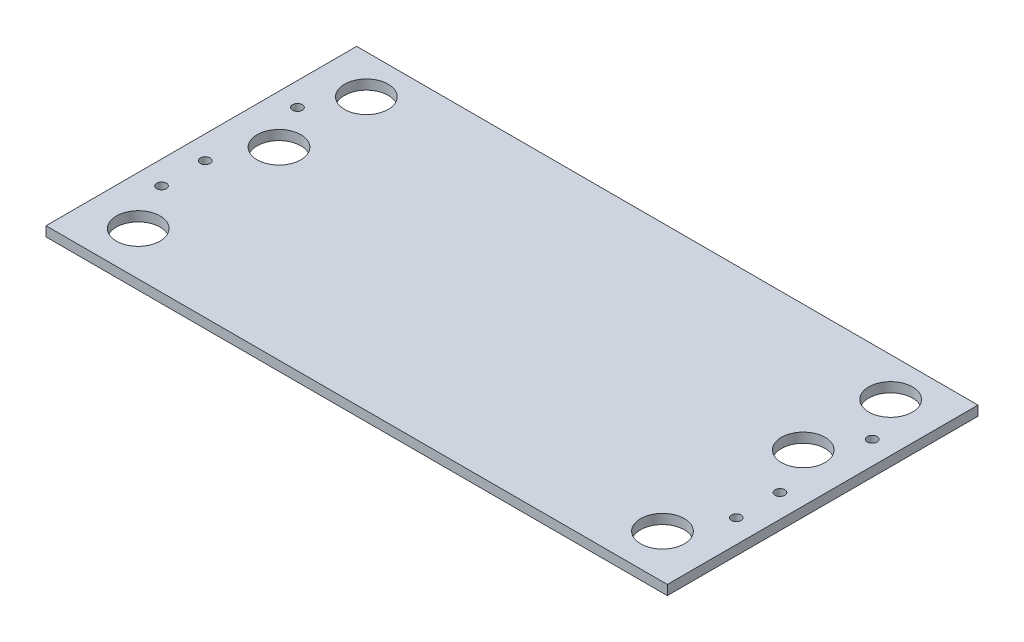
ISO-10303-21;
HEADER;
FILE_DESCRIPTION(('STEP AP214'),'2;1');
FILE_NAME('part.step','',(''),(''),'','','');
FILE_SCHEMA(('AUTOMOTIVE_DESIGN { 1 0 10303 214 1 1 1 1 }'));
ENDSEC;
DATA;
#1=APPLICATION_CONTEXT('core data for automotive mechanical design processes');
#2=APPLICATION_PROTOCOL_DEFINITION('international standard','automotive_design',2000,#1);
#3=PRODUCT_CONTEXT('',#1,'mechanical');
#4=PRODUCT('Part','Part','',(#3));
#5=PRODUCT_RELATED_PRODUCT_CATEGORY('part','',(#4));
#6=PRODUCT_DEFINITION_FORMATION('','',#4);
#7=PRODUCT_DEFINITION_CONTEXT('part definition',#1,'design');
#8=PRODUCT_DEFINITION('design','',#6,#7);
#9=PRODUCT_DEFINITION_SHAPE('','',#8);
#10=(LENGTH_UNIT() NAMED_UNIT(*) SI_UNIT(.MILLI.,.METRE.));
#11=(NAMED_UNIT(*) PLANE_ANGLE_UNIT() SI_UNIT($,.RADIAN.));
#12=(NAMED_UNIT(*) SI_UNIT($,.STERADIAN.) SOLID_ANGLE_UNIT());
#13=UNCERTAINTY_MEASURE_WITH_UNIT(LENGTH_MEASURE(1.E-05),#10,'distance_accuracy_value','');
#14=(GEOMETRIC_REPRESENTATION_CONTEXT(3) GLOBAL_UNCERTAINTY_ASSIGNED_CONTEXT((#13)) GLOBAL_UNIT_ASSIGNED_CONTEXT((#10,
#11,#12)) REPRESENTATION_CONTEXT('',''));
#15=CARTESIAN_POINT('',(0.,0.,0.));
#16=DIRECTION('',(0.,0.,1.));
#17=DIRECTION('',(1.,0.,0.));
#18=AXIS2_PLACEMENT_3D('',#15,#16,#17);
#19=CARTESIAN_POINT('',(0.,6.35,0.));
#20=DIRECTION('',(0.,-1.,0.));
#21=DIRECTION('',(0.,0.,-1.));
#22=AXIS2_PLACEMENT_3D('',#19,#20,#21);
#23=PLANE('',#22);
#24=DIRECTION('',(1.,0.,0.));
#25=VECTOR('',#24,1.);
#26=CARTESIAN_POINT('',(203.2,6.35,101.6));
#27=LINE('',#26,#25);
#28=CARTESIAN_POINT('',(-203.2,6.35,101.6));
#29=VERTEX_POINT('',#28);
#30=CARTESIAN_POINT('',(203.2,6.35,101.6));
#31=VERTEX_POINT('',#30);
#32=EDGE_CURVE('E96',#29,#31,#27,.T.);
#33=ORIENTED_EDGE('',*,*,#32,.T.);
#34=DIRECTION('',(0.,0.,-1.));
#35=VECTOR('',#34,1.);
#36=CARTESIAN_POINT('',(203.2,6.35,-101.6));
#37=LINE('',#36,#35);
#38=CARTESIAN_POINT('',(203.2,6.35,-101.6));
#39=VERTEX_POINT('',#38);
#40=EDGE_CURVE('E91',#31,#39,#37,.T.);
#41=ORIENTED_EDGE('',*,*,#40,.T.);
#42=DIRECTION('',(-1.,0.,0.));
#43=VECTOR('',#42,1.);
#44=CARTESIAN_POINT('',(-203.2,6.35,-101.6));
#45=LINE('',#44,#43);
#46=CARTESIAN_POINT('',(-203.2,6.35,-101.6));
#47=VERTEX_POINT('',#46);
#48=EDGE_CURVE('E94',#39,#47,#45,.T.);
#49=ORIENTED_EDGE('',*,*,#48,.T.);
#50=DIRECTION('',(0.,0.,1.));
#51=VECTOR('',#50,1.);
#52=CARTESIAN_POINT('',(-203.2,6.35,101.6));
#53=LINE('',#52,#51);
#54=EDGE_CURVE('E61',#47,#29,#53,.T.);
#55=ORIENTED_EDGE('',*,*,#54,.T.);
#56=EDGE_LOOP('',(#33,#41,#49,#55));
#57=FACE_BOUND('',#56,.T.);
#58=CARTESIAN_POINT('',(-171.45,6.35,-76.2));
#59=DIRECTION('',(0.,1.,0.));
#60=DIRECTION('',(0.,0.,1.));
#61=AXIS2_PLACEMENT_3D('',#58,#59,#60);
#62=CIRCLE('',#61,14.2875);
#63=CARTESIAN_POINT('',(-171.45,6.35,-61.9125));
#64=VERTEX_POINT('',#63);
#65=EDGE_CURVE('E116',#64,#64,#62,.T.);
#66=ORIENTED_EDGE('',*,*,#65,.F.);
#67=EDGE_LOOP('',(#66));
#68=FACE_BOUND('',#67,.T.);
#69=CARTESIAN_POINT('',(-171.45,6.35,-19.05));
#70=DIRECTION('',(0.,1.,0.));
#71=DIRECTION('',(0.,0.,1.));
#72=AXIS2_PLACEMENT_3D('',#69,#70,#71);
#73=CIRCLE('',#72,14.2875);
#74=CARTESIAN_POINT('',(-171.45,6.35,-4.76249999999999));
#75=VERTEX_POINT('',#74);
#76=EDGE_CURVE('E138',#75,#75,#73,.T.);
#77=ORIENTED_EDGE('',*,*,#76,.F.);
#78=EDGE_LOOP('',(#77));
#79=FACE_BOUND('',#78,.T.);
#80=CARTESIAN_POINT('',(171.45,6.35,-76.2));
#81=DIRECTION('',(0.,1.,0.));
#82=DIRECTION('',(0.,0.,1.));
#83=AXIS2_PLACEMENT_3D('',#80,#81,#82);
#84=CIRCLE('',#83,14.2875);
#85=CARTESIAN_POINT('',(171.45,6.35,-61.9125));
#86=VERTEX_POINT('',#85);
#87=EDGE_CURVE('E146',#86,#86,#84,.T.);
#88=ORIENTED_EDGE('',*,*,#87,.F.);
#89=EDGE_LOOP('',(#88));
#90=FACE_BOUND('',#89,.T.);
#91=CARTESIAN_POINT('',(171.45,6.35,-19.05));
#92=DIRECTION('',(0.,1.,0.));
#93=DIRECTION('',(0.,0.,1.));
#94=AXIS2_PLACEMENT_3D('',#91,#92,#93);
#95=CIRCLE('',#94,14.2875);
#96=CARTESIAN_POINT('',(171.45,6.35,-4.76249999999999));
#97=VERTEX_POINT('',#96);
#98=EDGE_CURVE('E154',#97,#97,#95,.T.);
#99=ORIENTED_EDGE('',*,*,#98,.F.);
#100=EDGE_LOOP('',(#99));
#101=FACE_BOUND('',#100,.T.);
#102=CARTESIAN_POINT('',(171.45,6.35,73.025));
#103=DIRECTION('',(0.,1.,0.));
#104=DIRECTION('',(0.,0.,1.));
#105=AXIS2_PLACEMENT_3D('',#102,#103,#104);
#106=CIRCLE('',#105,14.2875);
#107=CARTESIAN_POINT('',(171.45,6.35,87.3125));
#108=VERTEX_POINT('',#107);
#109=EDGE_CURVE('E162',#108,#108,#106,.T.);
#110=ORIENTED_EDGE('',*,*,#109,.F.);
#111=EDGE_LOOP('',(#110));
#112=FACE_BOUND('',#111,.T.);
#113=CARTESIAN_POINT('',(-171.45,6.35,73.025));
#114=DIRECTION('',(0.,1.,0.));
#115=DIRECTION('',(0.,0.,1.));
#116=AXIS2_PLACEMENT_3D('',#113,#114,#115);
#117=CIRCLE('',#116,14.2875);
#118=CARTESIAN_POINT('',(-171.45,6.35,87.3125));
#119=VERTEX_POINT('',#118);
#120=EDGE_CURVE('E170',#119,#119,#117,.T.);
#121=ORIENTED_EDGE('',*,*,#120,.F.);
#122=EDGE_LOOP('',(#121));
#123=FACE_BOUND('',#122,.T.);
#124=CARTESIAN_POINT('',(-187.96,6.35,12.7));
#125=DIRECTION('',(0.,1.,0.));
#126=DIRECTION('',(0.,0.,1.));
#127=AXIS2_PLACEMENT_3D('',#124,#125,#126);
#128=CIRCLE('',#127,3.175);
#129=CARTESIAN_POINT('',(-187.96,6.35,15.875));
#130=VERTEX_POINT('',#129);
#131=EDGE_CURVE('E178',#130,#130,#128,.T.);
#132=ORIENTED_EDGE('',*,*,#131,.F.);
#133=EDGE_LOOP('',(#132));
#134=FACE_BOUND('',#133,.T.);
#135=CARTESIAN_POINT('',(-187.96,6.35,41.275));
#136=DIRECTION('',(0.,1.,0.));
#137=DIRECTION('',(0.,0.,1.));
#138=AXIS2_PLACEMENT_3D('',#135,#136,#137);
#139=CIRCLE('',#138,3.175);
#140=CARTESIAN_POINT('',(-187.96,6.35,44.45));
#141=VERTEX_POINT('',#140);
#142=EDGE_CURVE('E186',#141,#141,#139,.T.);
#143=ORIENTED_EDGE('',*,*,#142,.F.);
#144=EDGE_LOOP('',(#143));
#145=FACE_BOUND('',#144,.T.);
#146=CARTESIAN_POINT('',(187.96,6.35,41.275));
#147=DIRECTION('',(0.,1.,0.));
#148=DIRECTION('',(0.,0.,-1.));
#149=AXIS2_PLACEMENT_3D('',#146,#147,#148);
#150=CIRCLE('',#149,3.175);
#151=CARTESIAN_POINT('',(187.96,6.35,38.1));
#152=VERTEX_POINT('',#151);
#153=EDGE_CURVE('E194',#152,#152,#150,.T.);
#154=ORIENTED_EDGE('',*,*,#153,.F.);
#155=EDGE_LOOP('',(#154));
#156=FACE_BOUND('',#155,.T.);
#157=CARTESIAN_POINT('',(187.96,6.35,12.7));
#158=DIRECTION('',(0.,1.,0.));
#159=DIRECTION('',(0.,0.,-1.));
#160=AXIS2_PLACEMENT_3D('',#157,#158,#159);
#161=CIRCLE('',#160,3.175);
#162=CARTESIAN_POINT('',(187.96,6.35,9.52500000000001));
#163=VERTEX_POINT('',#162);
#164=EDGE_CURVE('E202',#163,#163,#161,.T.);
#165=ORIENTED_EDGE('',*,*,#164,.F.);
#166=EDGE_LOOP('',(#165));
#167=FACE_BOUND('',#166,.T.);
#168=CARTESIAN_POINT('',(-187.96,6.35,-47.625));
#169=DIRECTION('',(0.,1.,0.));
#170=DIRECTION('',(0.,0.,1.));
#171=AXIS2_PLACEMENT_3D('',#168,#169,#170);
#172=CIRCLE('',#171,3.175);
#173=CARTESIAN_POINT('',(-187.96,6.35,-44.45));
#174=VERTEX_POINT('',#173);
#175=EDGE_CURVE('E210',#174,#174,#172,.T.);
#176=ORIENTED_EDGE('',*,*,#175,.F.);
#177=EDGE_LOOP('',(#176));
#178=FACE_BOUND('',#177,.T.);
#179=CARTESIAN_POINT('',(187.96,6.35,-47.6249999999999));
#180=DIRECTION('',(0.,1.,0.));
#181=DIRECTION('',(0.,0.,-1.));
#182=AXIS2_PLACEMENT_3D('',#179,#180,#181);
#183=CIRCLE('',#182,3.175);
#184=CARTESIAN_POINT('',(187.96,6.35,-50.7999999999999));
#185=VERTEX_POINT('',#184);
#186=EDGE_CURVE('E218',#185,#185,#183,.T.);
#187=ORIENTED_EDGE('',*,*,#186,.F.);
#188=EDGE_LOOP('',(#187));
#189=FACE_BOUND('',#188,.T.);
#190=ADVANCED_FACE('F43',(#57,#68,#79,#90,#101,#112,#123,#134,#145,#156,#167,#178,#189),#23,.F.);
#191=CARTESIAN_POINT('',(0.,0.,0.));
#192=DIRECTION('',(0.,-1.,0.));
#193=DIRECTION('',(0.,0.,-1.));
#194=AXIS2_PLACEMENT_3D('',#191,#192,#193);
#195=PLANE('',#194);
#196=CARTESIAN_POINT('',(-187.96,0.,-47.625));
#197=DIRECTION('',(0.,1.,0.));
#198=DIRECTION('',(0.,0.,1.));
#199=AXIS2_PLACEMENT_3D('',#196,#197,#198);
#200=CIRCLE('',#199,3.175);
#201=CARTESIAN_POINT('',(-187.96,0.,-44.45));
#202=VERTEX_POINT('',#201);
#203=EDGE_CURVE('E214',#202,#202,#200,.T.);
#204=ORIENTED_EDGE('',*,*,#203,.T.);
#205=EDGE_LOOP('',(#204));
#206=FACE_BOUND('',#205,.T.);
#207=CARTESIAN_POINT('',(187.96,0.,41.275));
#208=DIRECTION('',(0.,1.,0.));
#209=DIRECTION('',(0.,0.,-1.));
#210=AXIS2_PLACEMENT_3D('',#207,#208,#209);
#211=CIRCLE('',#210,3.175);
#212=CARTESIAN_POINT('',(187.96,0.,38.1));
#213=VERTEX_POINT('',#212);
#214=EDGE_CURVE('E198',#213,#213,#211,.T.);
#215=ORIENTED_EDGE('',*,*,#214,.T.);
#216=EDGE_LOOP('',(#215));
#217=FACE_BOUND('',#216,.T.);
#218=CARTESIAN_POINT('',(-187.96,0.,12.7));
#219=DIRECTION('',(0.,1.,0.));
#220=DIRECTION('',(0.,0.,1.));
#221=AXIS2_PLACEMENT_3D('',#218,#219,#220);
#222=CIRCLE('',#221,3.175);
#223=CARTESIAN_POINT('',(-187.96,0.,15.875));
#224=VERTEX_POINT('',#223);
#225=EDGE_CURVE('E182',#224,#224,#222,.T.);
#226=ORIENTED_EDGE('',*,*,#225,.T.);
#227=EDGE_LOOP('',(#226));
#228=FACE_BOUND('',#227,.T.);
#229=CARTESIAN_POINT('',(171.45,0.,73.025));
#230=DIRECTION('',(0.,1.,0.));
#231=DIRECTION('',(0.,0.,1.));
#232=AXIS2_PLACEMENT_3D('',#229,#230,#231);
#233=CIRCLE('',#232,14.2875);
#234=CARTESIAN_POINT('',(171.45,0.,87.3125));
#235=VERTEX_POINT('',#234);
#236=EDGE_CURVE('E166',#235,#235,#233,.T.);
#237=ORIENTED_EDGE('',*,*,#236,.T.);
#238=EDGE_LOOP('',(#237));
#239=FACE_BOUND('',#238,.T.);
#240=CARTESIAN_POINT('',(171.45,0.,-76.2));
#241=DIRECTION('',(0.,1.,0.));
#242=DIRECTION('',(0.,0.,1.));
#243=AXIS2_PLACEMENT_3D('',#240,#241,#242);
#244=CIRCLE('',#243,14.2875);
#245=CARTESIAN_POINT('',(171.45,0.,-61.9125));
#246=VERTEX_POINT('',#245);
#247=EDGE_CURVE('E150',#246,#246,#244,.T.);
#248=ORIENTED_EDGE('',*,*,#247,.T.);
#249=EDGE_LOOP('',(#248));
#250=FACE_BOUND('',#249,.T.);
#251=CARTESIAN_POINT('',(-171.45,0.,-76.2));
#252=DIRECTION('',(0.,1.,0.));
#253=DIRECTION('',(0.,0.,1.));
#254=AXIS2_PLACEMENT_3D('',#251,#252,#253);
#255=CIRCLE('',#254,14.2875);
#256=CARTESIAN_POINT('',(-171.45,0.,-61.9125));
#257=VERTEX_POINT('',#256);
#258=EDGE_CURVE('E134',#257,#257,#255,.T.);
#259=ORIENTED_EDGE('',*,*,#258,.T.);
#260=EDGE_LOOP('',(#259));
#261=FACE_BOUND('',#260,.T.);
#262=DIRECTION('',(1.,0.,0.));
#263=VECTOR('',#262,1.);
#264=CARTESIAN_POINT('',(203.2,0.,101.6));
#265=LINE('',#264,#263);
#266=CARTESIAN_POINT('',(-203.2,0.,101.6));
#267=VERTEX_POINT('',#266);
#268=CARTESIAN_POINT('',(203.2,0.,101.6));
#269=VERTEX_POINT('',#268);
#270=EDGE_CURVE('E112',#267,#269,#265,.T.);
#271=ORIENTED_EDGE('',*,*,#270,.F.);
#272=DIRECTION('',(0.,0.,1.));
#273=VECTOR('',#272,1.);
#274=CARTESIAN_POINT('',(-203.2,0.,101.6));
#275=LINE('',#274,#273);
#276=CARTESIAN_POINT('',(-203.2,0.,-101.6));
#277=VERTEX_POINT('',#276);
#278=EDGE_CURVE('E84',#277,#267,#275,.T.);
#279=ORIENTED_EDGE('',*,*,#278,.F.);
#280=DIRECTION('',(-1.,0.,0.));
#281=VECTOR('',#280,1.);
#282=CARTESIAN_POINT('',(-203.2,0.,-101.6));
#283=LINE('',#282,#281);
#284=CARTESIAN_POINT('',(203.2,0.,-101.6));
#285=VERTEX_POINT('',#284);
#286=EDGE_CURVE('E78',#285,#277,#283,.T.);
#287=ORIENTED_EDGE('',*,*,#286,.F.);
#288=DIRECTION('',(0.,0.,-1.));
#289=VECTOR('',#288,1.);
#290=CARTESIAN_POINT('',(203.2,0.,-101.6));
#291=LINE('',#290,#289);
#292=EDGE_CURVE('E101',#269,#285,#291,.T.);
#293=ORIENTED_EDGE('',*,*,#292,.F.);
#294=EDGE_LOOP('',(#271,#279,#287,#293));
#295=FACE_BOUND('',#294,.T.);
#296=CARTESIAN_POINT('',(-171.45,0.,-19.05));
#297=DIRECTION('',(0.,1.,0.));
#298=DIRECTION('',(0.,0.,1.));
#299=AXIS2_PLACEMENT_3D('',#296,#297,#298);
#300=CIRCLE('',#299,14.2875);
#301=CARTESIAN_POINT('',(-171.45,0.,-4.76249999999999));
#302=VERTEX_POINT('',#301);
#303=EDGE_CURVE('E142',#302,#302,#300,.T.);
#304=ORIENTED_EDGE('',*,*,#303,.T.);
#305=EDGE_LOOP('',(#304));
#306=FACE_BOUND('',#305,.T.);
#307=CARTESIAN_POINT('',(171.45,0.,-19.05));
#308=DIRECTION('',(0.,1.,0.));
#309=DIRECTION('',(0.,0.,1.));
#310=AXIS2_PLACEMENT_3D('',#307,#308,#309);
#311=CIRCLE('',#310,14.2875);
#312=CARTESIAN_POINT('',(171.45,0.,-4.76249999999999));
#313=VERTEX_POINT('',#312);
#314=EDGE_CURVE('E158',#313,#313,#311,.T.);
#315=ORIENTED_EDGE('',*,*,#314,.T.);
#316=EDGE_LOOP('',(#315));
#317=FACE_BOUND('',#316,.T.);
#318=CARTESIAN_POINT('',(-171.45,0.,73.025));
#319=DIRECTION('',(0.,1.,0.));
#320=DIRECTION('',(0.,0.,1.));
#321=AXIS2_PLACEMENT_3D('',#318,#319,#320);
#322=CIRCLE('',#321,14.2875);
#323=CARTESIAN_POINT('',(-171.45,0.,87.3125));
#324=VERTEX_POINT('',#323);
#325=EDGE_CURVE('E174',#324,#324,#322,.T.);
#326=ORIENTED_EDGE('',*,*,#325,.T.);
#327=EDGE_LOOP('',(#326));
#328=FACE_BOUND('',#327,.T.);
#329=CARTESIAN_POINT('',(-187.96,0.,41.275));
#330=DIRECTION('',(0.,1.,0.));
#331=DIRECTION('',(0.,0.,1.));
#332=AXIS2_PLACEMENT_3D('',#329,#330,#331);
#333=CIRCLE('',#332,3.175);
#334=CARTESIAN_POINT('',(-187.96,0.,44.45));
#335=VERTEX_POINT('',#334);
#336=EDGE_CURVE('E190',#335,#335,#333,.T.);
#337=ORIENTED_EDGE('',*,*,#336,.T.);
#338=EDGE_LOOP('',(#337));
#339=FACE_BOUND('',#338,.T.);
#340=CARTESIAN_POINT('',(187.96,0.,12.7));
#341=DIRECTION('',(0.,1.,0.));
#342=DIRECTION('',(0.,0.,-1.));
#343=AXIS2_PLACEMENT_3D('',#340,#341,#342);
#344=CIRCLE('',#343,3.175);
#345=CARTESIAN_POINT('',(187.96,0.,9.52500000000001));
#346=VERTEX_POINT('',#345);
#347=EDGE_CURVE('E206',#346,#346,#344,.T.);
#348=ORIENTED_EDGE('',*,*,#347,.T.);
#349=EDGE_LOOP('',(#348));
#350=FACE_BOUND('',#349,.T.);
#351=CARTESIAN_POINT('',(187.96,0.,-47.6249999999999));
#352=DIRECTION('',(0.,1.,0.));
#353=DIRECTION('',(0.,0.,-1.));
#354=AXIS2_PLACEMENT_3D('',#351,#352,#353);
#355=CIRCLE('',#354,3.175);
#356=CARTESIAN_POINT('',(187.96,0.,-50.7999999999999));
#357=VERTEX_POINT('',#356);
#358=EDGE_CURVE('E222',#357,#357,#355,.T.);
#359=ORIENTED_EDGE('',*,*,#358,.T.);
#360=EDGE_LOOP('',(#359));
#361=FACE_BOUND('',#360,.T.);
#362=ADVANCED_FACE('F129',(#206,#217,#228,#239,#250,#261,#295,#306,#317,#328,#339,#350,#361),
#195,.T.);
#363=CARTESIAN_POINT('',(203.2,6.35,101.6));
#364=DIRECTION('',(0.,0.,-1.));
#365=DIRECTION('',(-1.,0.,0.));
#366=AXIS2_PLACEMENT_3D('',#363,#364,#365);
#367=PLANE('',#366);
#368=ORIENTED_EDGE('',*,*,#270,.T.);
#369=DIRECTION('',(0.,-1.,0.));
#370=VECTOR('',#369,1.);
#371=CARTESIAN_POINT('',(203.2,6.35,101.6));
#372=LINE('',#371,#370);
#373=EDGE_CURVE('E11',#31,#269,#372,.T.);
#374=ORIENTED_EDGE('',*,*,#373,.F.);
#375=ORIENTED_EDGE('',*,*,#32,.F.);
#376=DIRECTION('',(0.,-1.,0.));
#377=VECTOR('',#376,1.);
#378=CARTESIAN_POINT('',(-203.2,6.35,101.6));
#379=LINE('',#378,#377);
#380=EDGE_CURVE('E108',#29,#267,#379,.T.);
#381=ORIENTED_EDGE('',*,*,#380,.T.);
#382=EDGE_LOOP('',(#368,#374,#375,#381));
#383=FACE_BOUND('',#382,.T.);
#384=ADVANCED_FACE('F45',(#383),#367,.F.);
#385=CARTESIAN_POINT('',(203.2,6.35,-101.6));
#386=DIRECTION('',(-1.,0.,0.));
#387=DIRECTION('',(0.,0.,1.));
#388=AXIS2_PLACEMENT_3D('',#385,#386,#387);
#389=PLANE('',#388);
#390=ORIENTED_EDGE('',*,*,#292,.T.);
#391=DIRECTION('',(0.,-1.,0.));
#392=VECTOR('',#391,1.);
#393=CARTESIAN_POINT('',(203.2,6.35,-101.6));
#394=LINE('',#393,#392);
#395=EDGE_CURVE('E53',#39,#285,#394,.T.);
#396=ORIENTED_EDGE('',*,*,#395,.F.);
#397=ORIENTED_EDGE('',*,*,#40,.F.);
#398=ORIENTED_EDGE('',*,*,#373,.T.);
#399=EDGE_LOOP('',(#390,#396,#397,#398));
#400=FACE_BOUND('',#399,.T.);
#401=ADVANCED_FACE('F100',(#400),#389,.F.);
#402=CARTESIAN_POINT('',(-203.2,6.35,-101.6));
#403=DIRECTION('',(0.,0.,1.));
#404=DIRECTION('',(1.,0.,0.));
#405=AXIS2_PLACEMENT_3D('',#402,#403,#404);
#406=PLANE('',#405);
#407=ORIENTED_EDGE('',*,*,#286,.T.);
#408=DIRECTION('',(0.,-1.,0.));
#409=VECTOR('',#408,1.);
#410=CARTESIAN_POINT('',(-203.2,6.35,-101.6));
#411=LINE('',#410,#409);
#412=EDGE_CURVE('E103',#47,#277,#411,.T.);
#413=ORIENTED_EDGE('',*,*,#412,.F.);
#414=ORIENTED_EDGE('',*,*,#48,.F.);
#415=ORIENTED_EDGE('',*,*,#395,.T.);
#416=EDGE_LOOP('',(#407,#413,#414,#415));
#417=FACE_BOUND('',#416,.T.);
#418=ADVANCED_FACE('F104',(#417),#406,.F.);
#419=CARTESIAN_POINT('',(-203.2,6.35,101.6));
#420=DIRECTION('',(1.,0.,0.));
#421=DIRECTION('',(0.,0.,-1.));
#422=AXIS2_PLACEMENT_3D('',#419,#420,#421);
#423=PLANE('',#422);
#424=ORIENTED_EDGE('',*,*,#278,.T.);
#425=ORIENTED_EDGE('',*,*,#380,.F.);
#426=ORIENTED_EDGE('',*,*,#54,.F.);
#427=ORIENTED_EDGE('',*,*,#412,.T.);
#428=EDGE_LOOP('',(#424,#425,#426,#427));
#429=FACE_BOUND('',#428,.T.);
#430=ADVANCED_FACE('F126',(#429),#423,.F.);
#431=CARTESIAN_POINT('',(-171.45,6.35,-76.2));
#432=DIRECTION('',(0.,-1.,0.));
#433=DIRECTION('',(0.,0.,-1.));
#434=AXIS2_PLACEMENT_3D('',#431,#432,#433);
#435=CYLINDRICAL_SURFACE('',#434,14.2875);
#436=ORIENTED_EDGE('',*,*,#65,.T.);
#437=EDGE_LOOP('',(#436));
#438=FACE_BOUND('',#437,.T.);
#439=ORIENTED_EDGE('',*,*,#258,.F.);
#440=EDGE_LOOP('',(#439));
#441=FACE_BOUND('',#440,.T.);
#442=ADVANCED_FACE('F241',(#438,#441),#435,.F.);
#443=CARTESIAN_POINT('',(-171.45,6.35,-19.05));
#444=DIRECTION('',(0.,-1.,0.));
#445=DIRECTION('',(0.,0.,-1.));
#446=AXIS2_PLACEMENT_3D('',#443,#444,#445);
#447=CYLINDRICAL_SURFACE('',#446,14.2875);
#448=ORIENTED_EDGE('',*,*,#76,.T.);
#449=EDGE_LOOP('',(#448));
#450=FACE_BOUND('',#449,.T.);
#451=ORIENTED_EDGE('',*,*,#303,.F.);
#452=EDGE_LOOP('',(#451));
#453=FACE_BOUND('',#452,.T.);
#454=ADVANCED_FACE('F295',(#450,#453),#447,.F.);
#455=CARTESIAN_POINT('',(171.45,6.35,-76.2));
#456=DIRECTION('',(0.,-1.,0.));
#457=DIRECTION('',(0.,0.,-1.));
#458=AXIS2_PLACEMENT_3D('',#455,#456,#457);
#459=CYLINDRICAL_SURFACE('',#458,14.2875);
#460=ORIENTED_EDGE('',*,*,#87,.T.);
#461=EDGE_LOOP('',(#460));
#462=FACE_BOUND('',#461,.T.);
#463=ORIENTED_EDGE('',*,*,#247,.F.);
#464=EDGE_LOOP('',(#463));
#465=FACE_BOUND('',#464,.T.);
#466=ADVANCED_FACE('F304',(#462,#465),#459,.F.);
#467=CARTESIAN_POINT('',(171.45,6.35,-19.05));
#468=DIRECTION('',(0.,-1.,0.));
#469=DIRECTION('',(0.,0.,-1.));
#470=AXIS2_PLACEMENT_3D('',#467,#468,#469);
#471=CYLINDRICAL_SURFACE('',#470,14.2875);
#472=ORIENTED_EDGE('',*,*,#98,.T.);
#473=EDGE_LOOP('',(#472));
#474=FACE_BOUND('',#473,.T.);
#475=ORIENTED_EDGE('',*,*,#314,.F.);
#476=EDGE_LOOP('',(#475));
#477=FACE_BOUND('',#476,.T.);
#478=ADVANCED_FACE('F313',(#474,#477),#471,.F.);
#479=CARTESIAN_POINT('',(171.45,6.35,73.025));
#480=DIRECTION('',(0.,-1.,0.));
#481=DIRECTION('',(0.,0.,-1.));
#482=AXIS2_PLACEMENT_3D('',#479,#480,#481);
#483=CYLINDRICAL_SURFACE('',#482,14.2875);
#484=ORIENTED_EDGE('',*,*,#109,.T.);
#485=EDGE_LOOP('',(#484));
#486=FACE_BOUND('',#485,.T.);
#487=ORIENTED_EDGE('',*,*,#236,.F.);
#488=EDGE_LOOP('',(#487));
#489=FACE_BOUND('',#488,.T.);
#490=ADVANCED_FACE('F323',(#486,#489),#483,.F.);
#491=CARTESIAN_POINT('',(-171.45,6.35,73.025));
#492=DIRECTION('',(0.,-1.,0.));
#493=DIRECTION('',(0.,0.,-1.));
#494=AXIS2_PLACEMENT_3D('',#491,#492,#493);
#495=CYLINDRICAL_SURFACE('',#494,14.2875);
#496=ORIENTED_EDGE('',*,*,#120,.T.);
#497=EDGE_LOOP('',(#496));
#498=FACE_BOUND('',#497,.T.);
#499=ORIENTED_EDGE('',*,*,#325,.F.);
#500=EDGE_LOOP('',(#499));
#501=FACE_BOUND('',#500,.T.);
#502=ADVANCED_FACE('F333',(#498,#501),#495,.F.);
#503=CARTESIAN_POINT('',(-187.96,6.35,12.7));
#504=DIRECTION('',(0.,-1.,0.));
#505=DIRECTION('',(0.,0.,-1.));
#506=AXIS2_PLACEMENT_3D('',#503,#504,#505);
#507=CYLINDRICAL_SURFACE('',#506,3.175);
#508=ORIENTED_EDGE('',*,*,#131,.T.);
#509=EDGE_LOOP('',(#508));
#510=FACE_BOUND('',#509,.T.);
#511=ORIENTED_EDGE('',*,*,#225,.F.);
#512=EDGE_LOOP('',(#511));
#513=FACE_BOUND('',#512,.T.);
#514=ADVANCED_FACE('F343',(#510,#513),#507,.F.);
#515=CARTESIAN_POINT('',(-187.96,6.35,41.275));
#516=DIRECTION('',(0.,-1.,0.));
#517=DIRECTION('',(0.,0.,-1.));
#518=AXIS2_PLACEMENT_3D('',#515,#516,#517);
#519=CYLINDRICAL_SURFACE('',#518,3.175);
#520=ORIENTED_EDGE('',*,*,#142,.T.);
#521=EDGE_LOOP('',(#520));
#522=FACE_BOUND('',#521,.T.);
#523=ORIENTED_EDGE('',*,*,#336,.F.);
#524=EDGE_LOOP('',(#523));
#525=FACE_BOUND('',#524,.T.);
#526=ADVANCED_FACE('F353',(#522,#525),#519,.F.);
#527=CARTESIAN_POINT('',(187.96,6.35,41.275));
#528=DIRECTION('',(0.,-1.,0.));
#529=DIRECTION('',(0.,0.,-1.));
#530=AXIS2_PLACEMENT_3D('',#527,#528,#529);
#531=CYLINDRICAL_SURFACE('',#530,3.175);
#532=ORIENTED_EDGE('',*,*,#153,.T.);
#533=EDGE_LOOP('',(#532));
#534=FACE_BOUND('',#533,.T.);
#535=ORIENTED_EDGE('',*,*,#214,.F.);
#536=EDGE_LOOP('',(#535));
#537=FACE_BOUND('',#536,.T.);
#538=ADVANCED_FACE('F363',(#534,#537),#531,.F.);
#539=CARTESIAN_POINT('',(187.96,6.35,12.7));
#540=DIRECTION('',(0.,-1.,0.));
#541=DIRECTION('',(0.,0.,-1.));
#542=AXIS2_PLACEMENT_3D('',#539,#540,#541);
#543=CYLINDRICAL_SURFACE('',#542,3.175);
#544=ORIENTED_EDGE('',*,*,#164,.T.);
#545=EDGE_LOOP('',(#544));
#546=FACE_BOUND('',#545,.T.);
#547=ORIENTED_EDGE('',*,*,#347,.F.);
#548=EDGE_LOOP('',(#547));
#549=FACE_BOUND('',#548,.T.);
#550=ADVANCED_FACE('F373',(#546,#549),#543,.F.);
#551=CARTESIAN_POINT('',(-187.96,6.35,-47.625));
#552=DIRECTION('',(0.,-1.,0.));
#553=DIRECTION('',(0.,0.,-1.));
#554=AXIS2_PLACEMENT_3D('',#551,#552,#553);
#555=CYLINDRICAL_SURFACE('',#554,3.175);
#556=ORIENTED_EDGE('',*,*,#175,.T.);
#557=EDGE_LOOP('',(#556));
#558=FACE_BOUND('',#557,.T.);
#559=ORIENTED_EDGE('',*,*,#203,.F.);
#560=EDGE_LOOP('',(#559));
#561=FACE_BOUND('',#560,.T.);
#562=ADVANCED_FACE('F383',(#558,#561),#555,.F.);
#563=CARTESIAN_POINT('',(187.96,6.35,-47.6249999999999));
#564=DIRECTION('',(0.,-1.,0.));
#565=DIRECTION('',(0.,0.,-1.));
#566=AXIS2_PLACEMENT_3D('',#563,#564,#565);
#567=CYLINDRICAL_SURFACE('',#566,3.175);
#568=ORIENTED_EDGE('',*,*,#186,.T.);
#569=EDGE_LOOP('',(#568));
#570=FACE_BOUND('',#569,.T.);
#571=ORIENTED_EDGE('',*,*,#358,.F.);
#572=EDGE_LOOP('',(#571));
#573=FACE_BOUND('',#572,.T.);
#574=ADVANCED_FACE('F230',(#570,#573),#567,.F.);
#575=CLOSED_SHELL('',(#190,#362,#384,#401,#418,#430,#442,#454,#466,#478,#490,#502,#514,#526,
#538,#550,#562,#574));
#576=MANIFOLD_SOLID_BREP('B2',#575);
#577=ADVANCED_BREP_SHAPE_REPRESENTATION('',(#18,#576),#14);
#578=SHAPE_DEFINITION_REPRESENTATION(#9,#577);
ENDSEC;
END-ISO-10303-21;
